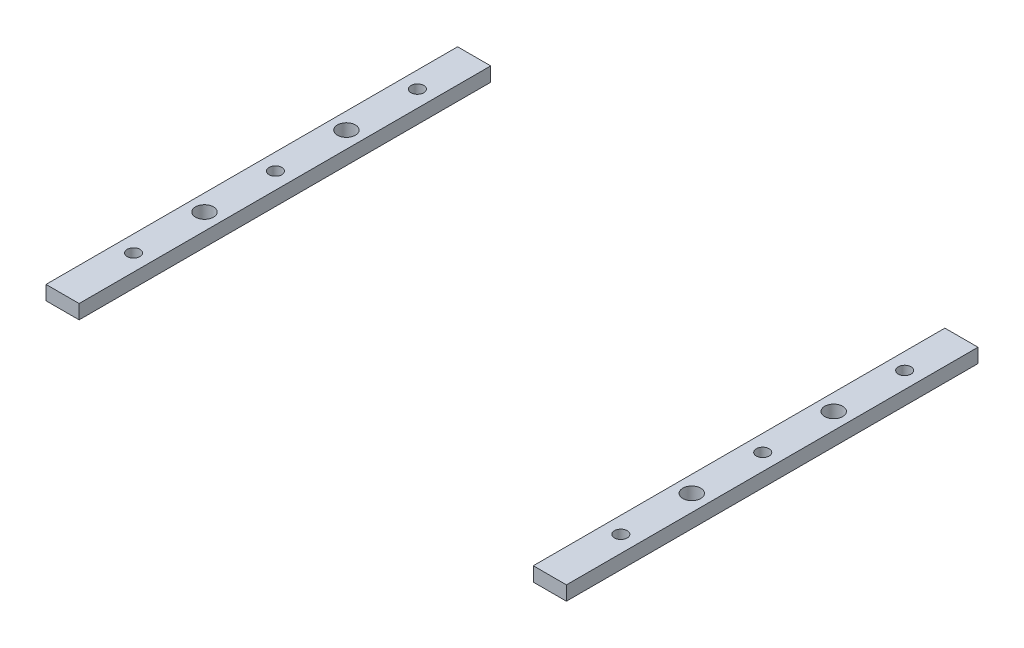
ISO-10303-21;
HEADER;
FILE_DESCRIPTION(('STEP AP214'),'2;1');
FILE_NAME('part.step','',(''),(''),'','','');
FILE_SCHEMA(('AUTOMOTIVE_DESIGN { 1 0 10303 214 1 1 1 1 }'));
ENDSEC;
DATA;
#1=APPLICATION_CONTEXT('core data for automotive mechanical design processes');
#2=APPLICATION_PROTOCOL_DEFINITION('international standard','automotive_design',2000,#1);
#3=PRODUCT_CONTEXT('',#1,'mechanical');
#4=PRODUCT('Part','Part','',(#3));
#5=PRODUCT_RELATED_PRODUCT_CATEGORY('part','',(#4));
#6=PRODUCT_DEFINITION_FORMATION('','',#4);
#7=PRODUCT_DEFINITION_CONTEXT('part definition',#1,'design');
#8=PRODUCT_DEFINITION('design','',#6,#7);
#9=PRODUCT_DEFINITION_SHAPE('','',#8);
#10=(LENGTH_UNIT() NAMED_UNIT(*) SI_UNIT(.MILLI.,.METRE.));
#11=(NAMED_UNIT(*) PLANE_ANGLE_UNIT() SI_UNIT($,.RADIAN.));
#12=(NAMED_UNIT(*) SI_UNIT($,.STERADIAN.) SOLID_ANGLE_UNIT());
#13=UNCERTAINTY_MEASURE_WITH_UNIT(LENGTH_MEASURE(1.E-05),#10,'distance_accuracy_value','');
#14=(GEOMETRIC_REPRESENTATION_CONTEXT(3) GLOBAL_UNCERTAINTY_ASSIGNED_CONTEXT((#13)) GLOBAL_UNIT_ASSIGNED_CONTEXT((#10,
#11,#12)) REPRESENTATION_CONTEXT('',''));
#15=CARTESIAN_POINT('',(0.,0.,0.));
#16=DIRECTION('',(0.,0.,1.));
#17=DIRECTION('',(1.,0.,0.));
#18=AXIS2_PLACEMENT_3D('',#15,#16,#17);
#19=CARTESIAN_POINT('',(0.,3.,0.));
#20=DIRECTION('',(0.,1.,0.));
#21=DIRECTION('',(0.,0.,1.));
#22=AXIS2_PLACEMENT_3D('',#19,#20,#21);
#23=PLANE('',#22);
#24=CARTESIAN_POINT('',(106.5,3.,-30.));
#25=DIRECTION('',(0.,-1.,0.));
#26=DIRECTION('',(0.,0.,-1.));
#27=AXIS2_PLACEMENT_3D('',#24,#25,#26);
#28=CIRCLE('',#27,1.9);
#29=CARTESIAN_POINT('',(106.5,3.,-31.9));
#30=VERTEX_POINT('',#29);
#31=EDGE_CURVE('E136',#30,#30,#28,.T.);
#32=ORIENTED_EDGE('',*,*,#31,.T.);
#33=EDGE_LOOP('',(#32));
#34=FACE_BOUND('',#33,.T.);
#35=CARTESIAN_POINT('',(106.5,3.,-60.));
#36=DIRECTION('',(0.,-1.,0.));
#37=DIRECTION('',(0.,0.,-1.));
#38=AXIS2_PLACEMENT_3D('',#35,#36,#37);
#39=CIRCLE('',#38,1.9);
#40=CARTESIAN_POINT('',(106.5,3.,-61.9));
#41=VERTEX_POINT('',#40);
#42=EDGE_CURVE('E142',#41,#41,#39,.T.);
#43=ORIENTED_EDGE('',*,*,#42,.T.);
#44=EDGE_LOOP('',(#43));
#45=FACE_BOUND('',#44,.T.);
#46=DIRECTION('',(1.,0.,0.));
#47=VECTOR('',#46,1.);
#48=CARTESIAN_POINT('',(103.,3.,0.));
#49=LINE('',#48,#47);
#50=CARTESIAN_POINT('',(103.,3.,0.));
#51=VERTEX_POINT('',#50);
#52=CARTESIAN_POINT('',(110.,3.,0.));
#53=VERTEX_POINT('',#52);
#54=EDGE_CURVE('E94',#51,#53,#49,.T.);
#55=ORIENTED_EDGE('',*,*,#54,.T.);
#56=DIRECTION('',(0.,0.,-1.));
#57=VECTOR('',#56,1.);
#58=CARTESIAN_POINT('',(110.,3.,0.));
#59=LINE('',#58,#57);
#60=CARTESIAN_POINT('',(110.,3.,-87.));
#61=VERTEX_POINT('',#60);
#62=EDGE_CURVE('E89',#53,#61,#59,.T.);
#63=ORIENTED_EDGE('',*,*,#62,.T.);
#64=DIRECTION('',(-1.,0.,0.));
#65=VECTOR('',#64,1.);
#66=CARTESIAN_POINT('',(103.,3.,-87.));
#67=LINE('',#66,#65);
#68=CARTESIAN_POINT('',(103.,3.,-87.));
#69=VERTEX_POINT('',#68);
#70=EDGE_CURVE('E92',#61,#69,#67,.T.);
#71=ORIENTED_EDGE('',*,*,#70,.T.);
#72=DIRECTION('',(0.,0.,1.));
#73=VECTOR('',#72,1.);
#74=CARTESIAN_POINT('',(103.,3.,0.));
#75=LINE('',#74,#73);
#76=EDGE_CURVE('E59',#69,#51,#75,.T.);
#77=ORIENTED_EDGE('',*,*,#76,.T.);
#78=EDGE_LOOP('',(#55,#63,#71,#77));
#79=FACE_BOUND('',#78,.T.);
#80=CARTESIAN_POINT('',(106.5,3.,-15.));
#81=DIRECTION('',(0.,1.,0.));
#82=DIRECTION('',(0.,0.,1.));
#83=AXIS2_PLACEMENT_3D('',#80,#81,#82);
#84=CIRCLE('',#83,1.34999999999999);
#85=CARTESIAN_POINT('',(106.5,3.,-13.65));
#86=VERTEX_POINT('',#85);
#87=EDGE_CURVE('E109',#86,#86,#84,.T.);
#88=ORIENTED_EDGE('',*,*,#87,.F.);
#89=EDGE_LOOP('',(#88));
#90=FACE_BOUND('',#89,.T.);
#91=CARTESIAN_POINT('',(106.5,3.,-45.));
#92=DIRECTION('',(0.,1.,0.));
#93=DIRECTION('',(0.,0.,1.));
#94=AXIS2_PLACEMENT_3D('',#91,#92,#93);
#95=CIRCLE('',#94,1.35000000000001);
#96=CARTESIAN_POINT('',(106.5,3.,-43.65));
#97=VERTEX_POINT('',#96);
#98=EDGE_CURVE('E124',#97,#97,#95,.T.);
#99=ORIENTED_EDGE('',*,*,#98,.F.);
#100=EDGE_LOOP('',(#99));
#101=FACE_BOUND('',#100,.T.);
#102=CARTESIAN_POINT('',(106.5,3.,-75.));
#103=DIRECTION('',(0.,1.,0.));
#104=DIRECTION('',(0.,0.,1.));
#105=AXIS2_PLACEMENT_3D('',#102,#103,#104);
#106=CIRCLE('',#105,1.34999999999999);
#107=CARTESIAN_POINT('',(106.5,3.,-73.65));
#108=VERTEX_POINT('',#107);
#109=EDGE_CURVE('E130',#108,#108,#106,.T.);
#110=ORIENTED_EDGE('',*,*,#109,.F.);
#111=EDGE_LOOP('',(#110));
#112=FACE_BOUND('',#111,.T.);
#113=ADVANCED_FACE('F42',(#34,#45,#79,#90,#101,#112),#23,.T.);
#114=CARTESIAN_POINT('',(0.,0.,0.));
#115=DIRECTION('',(0.,1.,0.));
#116=DIRECTION('',(0.,0.,1.));
#117=AXIS2_PLACEMENT_3D('',#114,#115,#116);
#118=PLANE('',#117);
#119=CARTESIAN_POINT('',(106.5,0.,-30.));
#120=DIRECTION('',(0.,-1.,0.));
#121=DIRECTION('',(0.,0.,-1.));
#122=AXIS2_PLACEMENT_3D('',#119,#120,#121);
#123=CIRCLE('',#122,1.9);
#124=CARTESIAN_POINT('',(106.5,0.,-31.9));
#125=VERTEX_POINT('',#124);
#126=EDGE_CURVE('E145',#125,#125,#123,.T.);
#127=ORIENTED_EDGE('',*,*,#126,.F.);
#128=EDGE_LOOP('',(#127));
#129=FACE_BOUND('',#128,.T.);
#130=CARTESIAN_POINT('',(106.5,0.,-60.));
#131=DIRECTION('',(0.,-1.,0.));
#132=DIRECTION('',(0.,0.,-1.));
#133=AXIS2_PLACEMENT_3D('',#130,#131,#132);
#134=CIRCLE('',#133,1.9);
#135=CARTESIAN_POINT('',(106.5,0.,-61.9));
#136=VERTEX_POINT('',#135);
#137=EDGE_CURVE('E139',#136,#136,#134,.T.);
#138=ORIENTED_EDGE('',*,*,#137,.F.);
#139=EDGE_LOOP('',(#138));
#140=FACE_BOUND('',#139,.T.);
#141=DIRECTION('',(1.,0.,0.));
#142=VECTOR('',#141,1.);
#143=CARTESIAN_POINT('',(103.,0.,0.));
#144=LINE('',#143,#142);
#145=CARTESIAN_POINT('',(103.,0.,0.));
#146=VERTEX_POINT('',#145);
#147=CARTESIAN_POINT('',(110.,0.,0.));
#148=VERTEX_POINT('',#147);
#149=EDGE_CURVE('E106',#146,#148,#144,.T.);
#150=ORIENTED_EDGE('',*,*,#149,.F.);
#151=DIRECTION('',(0.,0.,1.));
#152=VECTOR('',#151,1.);
#153=CARTESIAN_POINT('',(103.,0.,0.));
#154=LINE('',#153,#152);
#155=CARTESIAN_POINT('',(103.,0.,-87.));
#156=VERTEX_POINT('',#155);
#157=EDGE_CURVE('E82',#156,#146,#154,.T.);
#158=ORIENTED_EDGE('',*,*,#157,.F.);
#159=DIRECTION('',(-1.,0.,0.));
#160=VECTOR('',#159,1.);
#161=CARTESIAN_POINT('',(103.,0.,-87.));
#162=LINE('',#161,#160);
#163=CARTESIAN_POINT('',(110.,0.,-87.));
#164=VERTEX_POINT('',#163);
#165=EDGE_CURVE('E76',#164,#156,#162,.T.);
#166=ORIENTED_EDGE('',*,*,#165,.F.);
#167=DIRECTION('',(0.,0.,-1.));
#168=VECTOR('',#167,1.);
#169=CARTESIAN_POINT('',(110.,0.,0.));
#170=LINE('',#169,#168);
#171=EDGE_CURVE('E98',#148,#164,#170,.T.);
#172=ORIENTED_EDGE('',*,*,#171,.F.);
#173=EDGE_LOOP('',(#150,#158,#166,#172));
#174=FACE_BOUND('',#173,.T.);
#175=CARTESIAN_POINT('',(106.5,0.,-15.));
#176=DIRECTION('',(0.,1.,0.));
#177=DIRECTION('',(0.,0.,1.));
#178=AXIS2_PLACEMENT_3D('',#175,#176,#177);
#179=CIRCLE('',#178,1.34999999999999);
#180=CARTESIAN_POINT('',(106.5,0.,-13.65));
#181=VERTEX_POINT('',#180);
#182=EDGE_CURVE('E121',#181,#181,#179,.T.);
#183=ORIENTED_EDGE('',*,*,#182,.T.);
#184=EDGE_LOOP('',(#183));
#185=FACE_BOUND('',#184,.T.);
#186=CARTESIAN_POINT('',(106.5,0.,-45.));
#187=DIRECTION('',(0.,1.,0.));
#188=DIRECTION('',(0.,0.,1.));
#189=AXIS2_PLACEMENT_3D('',#186,#187,#188);
#190=CIRCLE('',#189,1.35000000000001);
#191=CARTESIAN_POINT('',(106.5,0.,-43.65));
#192=VERTEX_POINT('',#191);
#193=EDGE_CURVE('E127',#192,#192,#190,.T.);
#194=ORIENTED_EDGE('',*,*,#193,.T.);
#195=EDGE_LOOP('',(#194));
#196=FACE_BOUND('',#195,.T.);
#197=CARTESIAN_POINT('',(106.5,0.,-75.));
#198=DIRECTION('',(0.,1.,0.));
#199=DIRECTION('',(0.,0.,1.));
#200=AXIS2_PLACEMENT_3D('',#197,#198,#199);
#201=CIRCLE('',#200,1.34999999999999);
#202=CARTESIAN_POINT('',(106.5,0.,-73.65));
#203=VERTEX_POINT('',#202);
#204=EDGE_CURVE('E133',#203,#203,#201,.T.);
#205=ORIENTED_EDGE('',*,*,#204,.T.);
#206=EDGE_LOOP('',(#205));
#207=FACE_BOUND('',#206,.T.);
#208=ADVANCED_FACE('F117',(#129,#140,#174,#185,#196,#207),#118,.F.);
#209=CARTESIAN_POINT('',(103.,3.,0.));
#210=DIRECTION('',(0.,0.,-1.));
#211=DIRECTION('',(-1.,0.,0.));
#212=AXIS2_PLACEMENT_3D('',#209,#210,#211);
#213=PLANE('',#212);
#214=ORIENTED_EDGE('',*,*,#149,.T.);
#215=DIRECTION('',(0.,-1.,0.));
#216=VECTOR('',#215,1.);
#217=CARTESIAN_POINT('',(110.,3.,0.));
#218=LINE('',#217,#216);
#219=EDGE_CURVE('E12',#53,#148,#218,.T.);
#220=ORIENTED_EDGE('',*,*,#219,.F.);
#221=ORIENTED_EDGE('',*,*,#54,.F.);
#222=DIRECTION('',(0.,-1.,0.));
#223=VECTOR('',#222,1.);
#224=CARTESIAN_POINT('',(103.,3.,0.));
#225=LINE('',#224,#223);
#226=EDGE_CURVE('E102',#51,#146,#225,.T.);
#227=ORIENTED_EDGE('',*,*,#226,.T.);
#228=EDGE_LOOP('',(#214,#220,#221,#227));
#229=FACE_BOUND('',#228,.T.);
#230=ADVANCED_FACE('F44',(#229),#213,.F.);
#231=CARTESIAN_POINT('',(110.,3.,0.));
#232=DIRECTION('',(-1.,0.,0.));
#233=DIRECTION('',(0.,0.,1.));
#234=AXIS2_PLACEMENT_3D('',#231,#232,#233);
#235=PLANE('',#234);
#236=ORIENTED_EDGE('',*,*,#171,.T.);
#237=DIRECTION('',(0.,-1.,0.));
#238=VECTOR('',#237,1.);
#239=CARTESIAN_POINT('',(110.,3.,-87.));
#240=LINE('',#239,#238);
#241=EDGE_CURVE('E51',#61,#164,#240,.T.);
#242=ORIENTED_EDGE('',*,*,#241,.F.);
#243=ORIENTED_EDGE('',*,*,#62,.F.);
#244=ORIENTED_EDGE('',*,*,#219,.T.);
#245=EDGE_LOOP('',(#236,#242,#243,#244));
#246=FACE_BOUND('',#245,.T.);
#247=ADVANCED_FACE('F97',(#246),#235,.F.);
#248=CARTESIAN_POINT('',(103.,3.,-87.));
#249=DIRECTION('',(0.,0.,1.));
#250=DIRECTION('',(1.,0.,0.));
#251=AXIS2_PLACEMENT_3D('',#248,#249,#250);
#252=PLANE('',#251);
#253=ORIENTED_EDGE('',*,*,#165,.T.);
#254=DIRECTION('',(0.,-1.,0.));
#255=VECTOR('',#254,1.);
#256=CARTESIAN_POINT('',(103.,3.,-87.));
#257=LINE('',#256,#255);
#258=EDGE_CURVE('E99',#69,#156,#257,.T.);
#259=ORIENTED_EDGE('',*,*,#258,.F.);
#260=ORIENTED_EDGE('',*,*,#70,.F.);
#261=ORIENTED_EDGE('',*,*,#241,.T.);
#262=EDGE_LOOP('',(#253,#259,#260,#261));
#263=FACE_BOUND('',#262,.T.);
#264=ADVANCED_FACE('F100',(#263),#252,.F.);
#265=CARTESIAN_POINT('',(103.,3.,0.));
#266=DIRECTION('',(1.,0.,0.));
#267=DIRECTION('',(0.,0.,-1.));
#268=AXIS2_PLACEMENT_3D('',#265,#266,#267);
#269=PLANE('',#268);
#270=ORIENTED_EDGE('',*,*,#157,.T.);
#271=ORIENTED_EDGE('',*,*,#226,.F.);
#272=ORIENTED_EDGE('',*,*,#76,.F.);
#273=ORIENTED_EDGE('',*,*,#258,.T.);
#274=EDGE_LOOP('',(#270,#271,#272,#273));
#275=FACE_BOUND('',#274,.T.);
#276=ADVANCED_FACE('F114',(#275),#269,.F.);
#277=CARTESIAN_POINT('',(106.5,3.,-15.));
#278=DIRECTION('',(0.,-1.,0.));
#279=DIRECTION('',(0.,0.,-1.));
#280=AXIS2_PLACEMENT_3D('',#277,#278,#279);
#281=CYLINDRICAL_SURFACE('',#280,1.34999999999999);
#282=ORIENTED_EDGE('',*,*,#87,.T.);
#283=EDGE_LOOP('',(#282));
#284=FACE_BOUND('',#283,.T.);
#285=ORIENTED_EDGE('',*,*,#182,.F.);
#286=EDGE_LOOP('',(#285));
#287=FACE_BOUND('',#286,.T.);
#288=ADVANCED_FACE('F181',(#284,#287),#281,.F.);
#289=CARTESIAN_POINT('',(106.5,3.,-45.));
#290=DIRECTION('',(0.,-1.,0.));
#291=DIRECTION('',(0.,0.,-1.));
#292=AXIS2_PLACEMENT_3D('',#289,#290,#291);
#293=CYLINDRICAL_SURFACE('',#292,1.35000000000001);
#294=ORIENTED_EDGE('',*,*,#98,.T.);
#295=EDGE_LOOP('',(#294));
#296=FACE_BOUND('',#295,.T.);
#297=ORIENTED_EDGE('',*,*,#193,.F.);
#298=EDGE_LOOP('',(#297));
#299=FACE_BOUND('',#298,.T.);
#300=ADVANCED_FACE('F172',(#296,#299),#293,.F.);
#301=CARTESIAN_POINT('',(106.5,3.,-75.));
#302=DIRECTION('',(0.,-1.,0.));
#303=DIRECTION('',(0.,0.,-1.));
#304=AXIS2_PLACEMENT_3D('',#301,#302,#303);
#305=CYLINDRICAL_SURFACE('',#304,1.34999999999999);
#306=ORIENTED_EDGE('',*,*,#109,.T.);
#307=EDGE_LOOP('',(#306));
#308=FACE_BOUND('',#307,.T.);
#309=ORIENTED_EDGE('',*,*,#204,.F.);
#310=EDGE_LOOP('',(#309));
#311=FACE_BOUND('',#310,.T.);
#312=ADVANCED_FACE('F166',(#308,#311),#305,.F.);
#313=CARTESIAN_POINT('',(106.5,3.,-60.));
#314=DIRECTION('',(0.,-1.,0.));
#315=DIRECTION('',(0.,0.,-1.));
#316=AXIS2_PLACEMENT_3D('',#313,#314,#315);
#317=CYLINDRICAL_SURFACE('',#316,1.9);
#318=ORIENTED_EDGE('',*,*,#42,.F.);
#319=EDGE_LOOP('',(#318));
#320=FACE_BOUND('',#319,.T.);
#321=ORIENTED_EDGE('',*,*,#137,.T.);
#322=EDGE_LOOP('',(#321));
#323=FACE_BOUND('',#322,.T.);
#324=ADVANCED_FACE('F156',(#320,#323),#317,.F.);
#325=CARTESIAN_POINT('',(106.5,3.,-30.));
#326=DIRECTION('',(0.,-1.,0.));
#327=DIRECTION('',(0.,0.,-1.));
#328=AXIS2_PLACEMENT_3D('',#325,#326,#327);
#329=CYLINDRICAL_SURFACE('',#328,1.9);
#330=ORIENTED_EDGE('',*,*,#31,.F.);
#331=EDGE_LOOP('',(#330));
#332=FACE_BOUND('',#331,.T.);
#333=ORIENTED_EDGE('',*,*,#126,.T.);
#334=EDGE_LOOP('',(#333));
#335=FACE_BOUND('',#334,.T.);
#336=ADVANCED_FACE('F153',(#332,#335),#329,.F.);
#337=CLOSED_SHELL('',(#113,#208,#230,#247,#264,#276,#288,#300,#312,#324,#336));
#338=MANIFOLD_SOLID_BREP('B2',#337);
#339=CARTESIAN_POINT('',(0.,3.,0.));
#340=DIRECTION('',(0.,-1.,0.));
#341=DIRECTION('',(0.,0.,-1.));
#342=AXIS2_PLACEMENT_3D('',#339,#340,#341);
#343=PLANE('',#342);
#344=CARTESIAN_POINT('',(3.49999999999995,3.,-30.));
#345=DIRECTION('',(0.,-1.,0.));
#346=DIRECTION('',(0.,0.,-1.));
#347=AXIS2_PLACEMENT_3D('',#344,#345,#346);
#348=CIRCLE('',#347,1.9);
#349=CARTESIAN_POINT('',(3.49999999999995,3.,-31.9));
#350=VERTEX_POINT('',#349);
#351=EDGE_CURVE('E364',#350,#350,#348,.T.);
#352=ORIENTED_EDGE('',*,*,#351,.T.);
#353=EDGE_LOOP('',(#352));
#354=FACE_BOUND('',#353,.T.);
#355=CARTESIAN_POINT('',(3.50000000000026,3.,-60.));
#356=DIRECTION('',(0.,-1.,0.));
#357=DIRECTION('',(0.,0.,-1.));
#358=AXIS2_PLACEMENT_3D('',#355,#356,#357);
#359=CIRCLE('',#358,1.9);
#360=CARTESIAN_POINT('',(3.50000000000026,3.,-61.9));
#361=VERTEX_POINT('',#360);
#362=EDGE_CURVE('E370',#361,#361,#359,.T.);
#363=ORIENTED_EDGE('',*,*,#362,.T.);
#364=EDGE_LOOP('',(#363));
#365=FACE_BOUND('',#364,.T.);
#366=DIRECTION('',(0.,0.,1.));
#367=VECTOR('',#366,1.);
#368=CARTESIAN_POINT('',(0.,3.,0.));
#369=LINE('',#368,#367);
#370=CARTESIAN_POINT('',(0.,3.,-87.));
#371=VERTEX_POINT('',#370);
#372=CARTESIAN_POINT('',(0.,3.,0.));
#373=VERTEX_POINT('',#372);
#374=EDGE_CURVE('E322',#371,#373,#369,.T.);
#375=ORIENTED_EDGE('',*,*,#374,.T.);
#376=DIRECTION('',(1.,0.,0.));
#377=VECTOR('',#376,1.);
#378=CARTESIAN_POINT('',(0.,3.,0.));
#379=LINE('',#378,#377);
#380=CARTESIAN_POINT('',(7.,3.,0.));
#381=VERTEX_POINT('',#380);
#382=EDGE_CURVE('E317',#373,#381,#379,.T.);
#383=ORIENTED_EDGE('',*,*,#382,.T.);
#384=DIRECTION('',(0.,0.,-1.));
#385=VECTOR('',#384,1.);
#386=CARTESIAN_POINT('',(7.,3.,0.));
#387=LINE('',#386,#385);
#388=CARTESIAN_POINT('',(7.,3.,-87.));
#389=VERTEX_POINT('',#388);
#390=EDGE_CURVE('E320',#381,#389,#387,.T.);
#391=ORIENTED_EDGE('',*,*,#390,.T.);
#392=DIRECTION('',(-1.,0.,0.));
#393=VECTOR('',#392,1.);
#394=CARTESIAN_POINT('',(0.,3.,-87.));
#395=LINE('',#394,#393);
#396=EDGE_CURVE('E287',#389,#371,#395,.T.);
#397=ORIENTED_EDGE('',*,*,#396,.T.);
#398=EDGE_LOOP('',(#375,#383,#391,#397));
#399=FACE_BOUND('',#398,.T.);
#400=CARTESIAN_POINT('',(3.5,3.,-15.));
#401=DIRECTION('',(0.,1.,0.));
#402=DIRECTION('',(0.,0.,1.));
#403=AXIS2_PLACEMENT_3D('',#400,#401,#402);
#404=CIRCLE('',#403,1.35);
#405=CARTESIAN_POINT('',(3.5,3.,-13.65));
#406=VERTEX_POINT('',#405);
#407=EDGE_CURVE('E337',#406,#406,#404,.T.);
#408=ORIENTED_EDGE('',*,*,#407,.F.);
#409=EDGE_LOOP('',(#408));
#410=FACE_BOUND('',#409,.T.);
#411=CARTESIAN_POINT('',(3.4999999999999,3.,-45.));
#412=DIRECTION('',(0.,1.,0.));
#413=DIRECTION('',(0.,0.,1.));
#414=AXIS2_PLACEMENT_3D('',#411,#412,#413);
#415=CIRCLE('',#414,1.35);
#416=CARTESIAN_POINT('',(3.4999999999999,3.,-43.65));
#417=VERTEX_POINT('',#416);
#418=EDGE_CURVE('E352',#417,#417,#415,.T.);
#419=ORIENTED_EDGE('',*,*,#418,.F.);
#420=EDGE_LOOP('',(#419));
#421=FACE_BOUND('',#420,.T.);
#422=CARTESIAN_POINT('',(3.49999999999979,3.,-75.));
#423=DIRECTION('',(0.,1.,0.));
#424=DIRECTION('',(0.,0.,1.));
#425=AXIS2_PLACEMENT_3D('',#422,#423,#424);
#426=CIRCLE('',#425,1.35);
#427=CARTESIAN_POINT('',(3.49999999999979,3.,-73.65));
#428=VERTEX_POINT('',#427);
#429=EDGE_CURVE('E358',#428,#428,#426,.T.);
#430=ORIENTED_EDGE('',*,*,#429,.F.);
#431=EDGE_LOOP('',(#430));
#432=FACE_BOUND('',#431,.T.);
#433=ADVANCED_FACE('F270',(#354,#365,#399,#410,#421,#432),#343,.F.);
#434=CARTESIAN_POINT('',(0.,0.,0.));
#435=DIRECTION('',(0.,-1.,0.));
#436=DIRECTION('',(0.,0.,-1.));
#437=AXIS2_PLACEMENT_3D('',#434,#435,#436);
#438=PLANE('',#437);
#439=CARTESIAN_POINT('',(3.49999999999995,0.,-30.));
#440=DIRECTION('',(0.,-1.,0.));
#441=DIRECTION('',(0.,0.,-1.));
#442=AXIS2_PLACEMENT_3D('',#439,#440,#441);
#443=CIRCLE('',#442,1.9);
#444=CARTESIAN_POINT('',(3.49999999999995,0.,-31.9));
#445=VERTEX_POINT('',#444);
#446=EDGE_CURVE('E373',#445,#445,#443,.T.);
#447=ORIENTED_EDGE('',*,*,#446,.F.);
#448=EDGE_LOOP('',(#447));
#449=FACE_BOUND('',#448,.T.);
#450=CARTESIAN_POINT('',(3.50000000000026,0.,-60.));
#451=DIRECTION('',(0.,-1.,0.));
#452=DIRECTION('',(0.,0.,-1.));
#453=AXIS2_PLACEMENT_3D('',#450,#451,#452);
#454=CIRCLE('',#453,1.9);
#455=CARTESIAN_POINT('',(3.50000000000026,0.,-61.9));
#456=VERTEX_POINT('',#455);
#457=EDGE_CURVE('E367',#456,#456,#454,.T.);
#458=ORIENTED_EDGE('',*,*,#457,.F.);
#459=EDGE_LOOP('',(#458));
#460=FACE_BOUND('',#459,.T.);
#461=DIRECTION('',(0.,0.,1.));
#462=VECTOR('',#461,1.);
#463=CARTESIAN_POINT('',(0.,0.,0.));
#464=LINE('',#463,#462);
#465=CARTESIAN_POINT('',(0.,0.,-87.));
#466=VERTEX_POINT('',#465);
#467=CARTESIAN_POINT('',(0.,0.,0.));
#468=VERTEX_POINT('',#467);
#469=EDGE_CURVE('E334',#466,#468,#464,.T.);
#470=ORIENTED_EDGE('',*,*,#469,.F.);
#471=DIRECTION('',(-1.,0.,0.));
#472=VECTOR('',#471,1.);
#473=CARTESIAN_POINT('',(0.,0.,-87.));
#474=LINE('',#473,#472);
#475=CARTESIAN_POINT('',(7.,0.,-87.));
#476=VERTEX_POINT('',#475);
#477=EDGE_CURVE('E310',#476,#466,#474,.T.);
#478=ORIENTED_EDGE('',*,*,#477,.F.);
#479=DIRECTION('',(0.,0.,-1.));
#480=VECTOR('',#479,1.);
#481=CARTESIAN_POINT('',(7.,0.,0.));
#482=LINE('',#481,#480);
#483=CARTESIAN_POINT('',(7.,0.,0.));
#484=VERTEX_POINT('',#483);
#485=EDGE_CURVE('E304',#484,#476,#482,.T.);
#486=ORIENTED_EDGE('',*,*,#485,.F.);
#487=DIRECTION('',(1.,0.,0.));
#488=VECTOR('',#487,1.);
#489=CARTESIAN_POINT('',(0.,0.,0.));
#490=LINE('',#489,#488);
#491=EDGE_CURVE('E326',#468,#484,#490,.T.);
#492=ORIENTED_EDGE('',*,*,#491,.F.);
#493=EDGE_LOOP('',(#470,#478,#486,#492));
#494=FACE_BOUND('',#493,.T.);
#495=CARTESIAN_POINT('',(3.5,0.,-15.));
#496=DIRECTION('',(0.,1.,0.));
#497=DIRECTION('',(0.,0.,1.));
#498=AXIS2_PLACEMENT_3D('',#495,#496,#497);
#499=CIRCLE('',#498,1.35);
#500=CARTESIAN_POINT('',(3.5,0.,-13.65));
#501=VERTEX_POINT('',#500);
#502=EDGE_CURVE('E349',#501,#501,#499,.T.);
#503=ORIENTED_EDGE('',*,*,#502,.T.);
#504=EDGE_LOOP('',(#503));
#505=FACE_BOUND('',#504,.T.);
#506=CARTESIAN_POINT('',(3.4999999999999,0.,-45.));
#507=DIRECTION('',(0.,1.,0.));
#508=DIRECTION('',(0.,0.,1.));
#509=AXIS2_PLACEMENT_3D('',#506,#507,#508);
#510=CIRCLE('',#509,1.35);
#511=CARTESIAN_POINT('',(3.4999999999999,0.,-43.65));
#512=VERTEX_POINT('',#511);
#513=EDGE_CURVE('E355',#512,#512,#510,.T.);
#514=ORIENTED_EDGE('',*,*,#513,.T.);
#515=EDGE_LOOP('',(#514));
#516=FACE_BOUND('',#515,.T.);
#517=CARTESIAN_POINT('',(3.49999999999979,0.,-75.));
#518=DIRECTION('',(0.,1.,0.));
#519=DIRECTION('',(0.,0.,1.));
#520=AXIS2_PLACEMENT_3D('',#517,#518,#519);
#521=CIRCLE('',#520,1.35);
#522=CARTESIAN_POINT('',(3.49999999999979,0.,-73.65));
#523=VERTEX_POINT('',#522);
#524=EDGE_CURVE('E361',#523,#523,#521,.T.);
#525=ORIENTED_EDGE('',*,*,#524,.T.);
#526=EDGE_LOOP('',(#525));
#527=FACE_BOUND('',#526,.T.);
#528=ADVANCED_FACE('F345',(#449,#460,#494,#505,#516,#527),#438,.T.);
#529=CARTESIAN_POINT('',(0.,3.,0.));
#530=DIRECTION('',(1.,0.,0.));
#531=DIRECTION('',(0.,0.,-1.));
#532=AXIS2_PLACEMENT_3D('',#529,#530,#531);
#533=PLANE('',#532);
#534=ORIENTED_EDGE('',*,*,#469,.T.);
#535=DIRECTION('',(0.,-1.,0.));
#536=VECTOR('',#535,1.);
#537=CARTESIAN_POINT('',(0.,3.,0.));
#538=LINE('',#537,#536);
#539=EDGE_CURVE('E40',#373,#468,#538,.T.);
#540=ORIENTED_EDGE('',*,*,#539,.F.);
#541=ORIENTED_EDGE('',*,*,#374,.F.);
#542=DIRECTION('',(0.,-1.,0.));
#543=VECTOR('',#542,1.);
#544=CARTESIAN_POINT('',(0.,3.,-87.));
#545=LINE('',#544,#543);
#546=EDGE_CURVE('E330',#371,#466,#545,.T.);
#547=ORIENTED_EDGE('',*,*,#546,.T.);
#548=EDGE_LOOP('',(#534,#540,#541,#547));
#549=FACE_BOUND('',#548,.T.);
#550=ADVANCED_FACE('F272',(#549),#533,.F.);
#551=CARTESIAN_POINT('',(0.,3.,0.));
#552=DIRECTION('',(0.,0.,-1.));
#553=DIRECTION('',(-1.,0.,0.));
#554=AXIS2_PLACEMENT_3D('',#551,#552,#553);
#555=PLANE('',#554);
#556=ORIENTED_EDGE('',*,*,#491,.T.);
#557=DIRECTION('',(0.,-1.,0.));
#558=VECTOR('',#557,1.);
#559=CARTESIAN_POINT('',(7.,3.,0.));
#560=LINE('',#559,#558);
#561=EDGE_CURVE('E279',#381,#484,#560,.T.);
#562=ORIENTED_EDGE('',*,*,#561,.F.);
#563=ORIENTED_EDGE('',*,*,#382,.F.);
#564=ORIENTED_EDGE('',*,*,#539,.T.);
#565=EDGE_LOOP('',(#556,#562,#563,#564));
#566=FACE_BOUND('',#565,.T.);
#567=ADVANCED_FACE('F325',(#566),#555,.F.);
#568=CARTESIAN_POINT('',(7.,3.,0.));
#569=DIRECTION('',(-1.,0.,0.));
#570=DIRECTION('',(0.,0.,1.));
#571=AXIS2_PLACEMENT_3D('',#568,#569,#570);
#572=PLANE('',#571);
#573=ORIENTED_EDGE('',*,*,#485,.T.);
#574=DIRECTION('',(0.,-1.,0.));
#575=VECTOR('',#574,1.);
#576=CARTESIAN_POINT('',(7.,3.,-87.));
#577=LINE('',#576,#575);
#578=EDGE_CURVE('E327',#389,#476,#577,.T.);
#579=ORIENTED_EDGE('',*,*,#578,.F.);
#580=ORIENTED_EDGE('',*,*,#390,.F.);
#581=ORIENTED_EDGE('',*,*,#561,.T.);
#582=EDGE_LOOP('',(#573,#579,#580,#581));
#583=FACE_BOUND('',#582,.T.);
#584=ADVANCED_FACE('F328',(#583),#572,.F.);
#585=CARTESIAN_POINT('',(0.,3.,-87.));
#586=DIRECTION('',(0.,0.,1.));
#587=DIRECTION('',(1.,0.,0.));
#588=AXIS2_PLACEMENT_3D('',#585,#586,#587);
#589=PLANE('',#588);
#590=ORIENTED_EDGE('',*,*,#477,.T.);
#591=ORIENTED_EDGE('',*,*,#546,.F.);
#592=ORIENTED_EDGE('',*,*,#396,.F.);
#593=ORIENTED_EDGE('',*,*,#578,.T.);
#594=EDGE_LOOP('',(#590,#591,#592,#593));
#595=FACE_BOUND('',#594,.T.);
#596=ADVANCED_FACE('F342',(#595),#589,.F.);
#597=CARTESIAN_POINT('',(3.5,3.,-15.));
#598=DIRECTION('',(0.,-1.,0.));
#599=DIRECTION('',(0.,0.,-1.));
#600=AXIS2_PLACEMENT_3D('',#597,#598,#599);
#601=CYLINDRICAL_SURFACE('',#600,1.35);
#602=ORIENTED_EDGE('',*,*,#407,.T.);
#603=EDGE_LOOP('',(#602));
#604=FACE_BOUND('',#603,.T.);
#605=ORIENTED_EDGE('',*,*,#502,.F.);
#606=EDGE_LOOP('',(#605));
#607=FACE_BOUND('',#606,.T.);
#608=ADVANCED_FACE('F409',(#604,#607),#601,.F.);
#609=CARTESIAN_POINT('',(3.4999999999999,3.,-45.));
#610=DIRECTION('',(0.,-1.,0.));
#611=DIRECTION('',(0.,0.,-1.));
#612=AXIS2_PLACEMENT_3D('',#609,#610,#611);
#613=CYLINDRICAL_SURFACE('',#612,1.35);
#614=ORIENTED_EDGE('',*,*,#418,.T.);
#615=EDGE_LOOP('',(#614));
#616=FACE_BOUND('',#615,.T.);
#617=ORIENTED_EDGE('',*,*,#513,.F.);
#618=EDGE_LOOP('',(#617));
#619=FACE_BOUND('',#618,.T.);
#620=ADVANCED_FACE('F400',(#616,#619),#613,.F.);
#621=CARTESIAN_POINT('',(3.49999999999979,3.,-75.));
#622=DIRECTION('',(0.,-1.,0.));
#623=DIRECTION('',(0.,0.,-1.));
#624=AXIS2_PLACEMENT_3D('',#621,#622,#623);
#625=CYLINDRICAL_SURFACE('',#624,1.35);
#626=ORIENTED_EDGE('',*,*,#429,.T.);
#627=EDGE_LOOP('',(#626));
#628=FACE_BOUND('',#627,.T.);
#629=ORIENTED_EDGE('',*,*,#524,.F.);
#630=EDGE_LOOP('',(#629));
#631=FACE_BOUND('',#630,.T.);
#632=ADVANCED_FACE('F394',(#628,#631),#625,.F.);
#633=CARTESIAN_POINT('',(3.50000000000026,3.,-60.));
#634=DIRECTION('',(0.,-1.,0.));
#635=DIRECTION('',(0.,0.,-1.));
#636=AXIS2_PLACEMENT_3D('',#633,#634,#635);
#637=CYLINDRICAL_SURFACE('',#636,1.9);
#638=ORIENTED_EDGE('',*,*,#362,.F.);
#639=EDGE_LOOP('',(#638));
#640=FACE_BOUND('',#639,.T.);
#641=ORIENTED_EDGE('',*,*,#457,.T.);
#642=EDGE_LOOP('',(#641));
#643=FACE_BOUND('',#642,.T.);
#644=ADVANCED_FACE('F384',(#640,#643),#637,.F.);
#645=CARTESIAN_POINT('',(3.49999999999995,3.,-30.));
#646=DIRECTION('',(0.,-1.,0.));
#647=DIRECTION('',(0.,0.,-1.));
#648=AXIS2_PLACEMENT_3D('',#645,#646,#647);
#649=CYLINDRICAL_SURFACE('',#648,1.9);
#650=ORIENTED_EDGE('',*,*,#351,.F.);
#651=EDGE_LOOP('',(#650));
#652=FACE_BOUND('',#651,.T.);
#653=ORIENTED_EDGE('',*,*,#446,.T.);
#654=EDGE_LOOP('',(#653));
#655=FACE_BOUND('',#654,.T.);
#656=ADVANCED_FACE('F381',(#652,#655),#649,.F.);
#657=CLOSED_SHELL('',(#433,#528,#550,#567,#584,#596,#608,#620,#632,#644,#656));
#658=MANIFOLD_SOLID_BREP('B6',#657);
#659=ADVANCED_BREP_SHAPE_REPRESENTATION('',(#18,#338,#658),#14);
#660=SHAPE_DEFINITION_REPRESENTATION(#9,#659);
ENDSEC;
END-ISO-10303-21;
